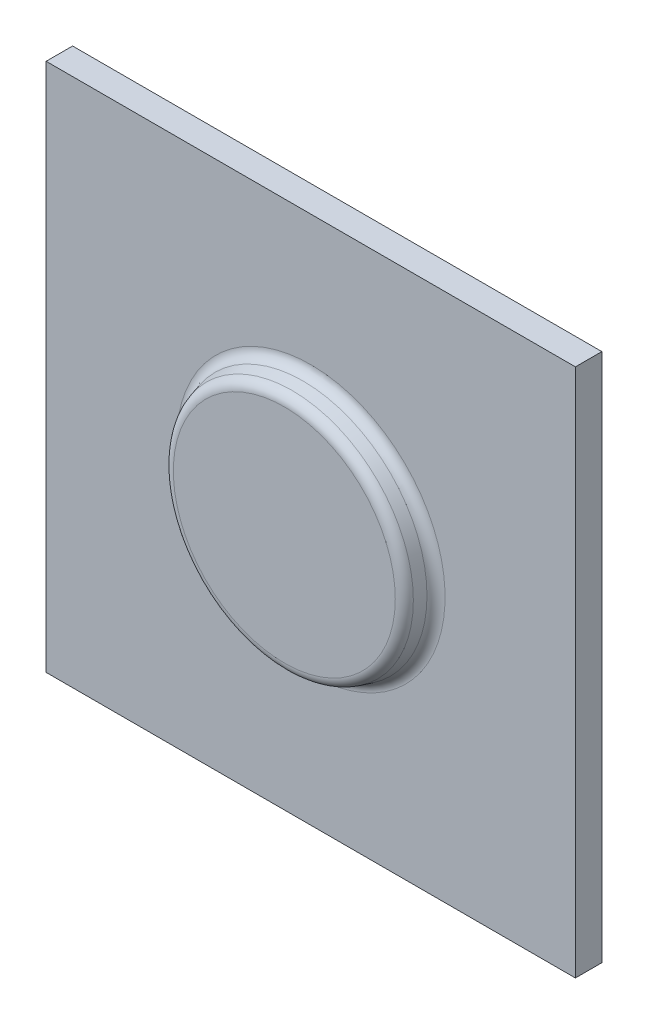
ISO-10303-21;
HEADER;
FILE_DESCRIPTION(('STEP AP214'),'2;1');
FILE_NAME('part.step','',(''),(''),'','','');
FILE_SCHEMA(('AUTOMOTIVE_DESIGN { 1 0 10303 214 1 1 1 1 }'));
ENDSEC;
DATA;
#1=APPLICATION_CONTEXT('core data for automotive mechanical design processes');
#2=APPLICATION_PROTOCOL_DEFINITION('international standard','automotive_design',2000,#1);
#3=PRODUCT_CONTEXT('',#1,'mechanical');
#4=PRODUCT('Part','Part','',(#3));
#5=PRODUCT_RELATED_PRODUCT_CATEGORY('part','',(#4));
#6=PRODUCT_DEFINITION_FORMATION('','',#4);
#7=PRODUCT_DEFINITION_CONTEXT('part definition',#1,'design');
#8=PRODUCT_DEFINITION('design','',#6,#7);
#9=PRODUCT_DEFINITION_SHAPE('','',#8);
#10=(LENGTH_UNIT() NAMED_UNIT(*) SI_UNIT(.MILLI.,.METRE.));
#11=(NAMED_UNIT(*) PLANE_ANGLE_UNIT() SI_UNIT($,.RADIAN.));
#12=(NAMED_UNIT(*) SI_UNIT($,.STERADIAN.) SOLID_ANGLE_UNIT());
#13=UNCERTAINTY_MEASURE_WITH_UNIT(LENGTH_MEASURE(1.E-05),#10,'distance_accuracy_value','');
#14=(GEOMETRIC_REPRESENTATION_CONTEXT(3) GLOBAL_UNCERTAINTY_ASSIGNED_CONTEXT((#13)) GLOBAL_UNIT_ASSIGNED_CONTEXT((#10,
#11,#12)) REPRESENTATION_CONTEXT('',''));
#15=CARTESIAN_POINT('',(0.,0.,0.));
#16=DIRECTION('',(0.,0.,1.));
#17=DIRECTION('',(1.,0.,0.));
#18=AXIS2_PLACEMENT_3D('',#15,#16,#17);
#19=CARTESIAN_POINT('',(-50.,50.,5.));
#20=DIRECTION('',(1.,0.,0.));
#21=DIRECTION('',(0.,1.,0.));
#22=AXIS2_PLACEMENT_3D('',#19,#20,#21);
#23=PLANE('',#22);
#24=DIRECTION('',(0.,-1.,0.));
#25=VECTOR('',#24,1.);
#26=CARTESIAN_POINT('',(-50.,50.,0.));
#27=LINE('',#26,#25);
#28=CARTESIAN_POINT('',(-50.,50.,0.));
#29=VERTEX_POINT('',#28);
#30=CARTESIAN_POINT('',(-50.,-50.,0.));
#31=VERTEX_POINT('',#30);
#32=EDGE_CURVE('E106',#29,#31,#27,.T.);
#33=ORIENTED_EDGE('',*,*,#32,.T.);
#34=DIRECTION('',(0.,0.,-1.));
#35=VECTOR('',#34,1.);
#36=CARTESIAN_POINT('',(-50.,-50.,5.));
#37=LINE('',#36,#35);
#38=CARTESIAN_POINT('',(-50.,-50.,5.));
#39=VERTEX_POINT('',#38);
#40=EDGE_CURVE('E97',#39,#31,#37,.T.);
#41=ORIENTED_EDGE('',*,*,#40,.F.);
#42=DIRECTION('',(0.,-1.,0.));
#43=VECTOR('',#42,1.);
#44=CARTESIAN_POINT('',(-50.,50.,5.));
#45=LINE('',#44,#43);
#46=CARTESIAN_POINT('',(-50.,50.,5.));
#47=VERTEX_POINT('',#46);
#48=EDGE_CURVE('E91',#47,#39,#45,.T.);
#49=ORIENTED_EDGE('',*,*,#48,.F.);
#50=DIRECTION('',(0.,0.,-1.));
#51=VECTOR('',#50,1.);
#52=CARTESIAN_POINT('',(-50.,50.,5.));
#53=LINE('',#52,#51);
#54=EDGE_CURVE('E102',#47,#29,#53,.T.);
#55=ORIENTED_EDGE('',*,*,#54,.T.);
#56=EDGE_LOOP('',(#33,#41,#49,#55));
#57=FACE_BOUND('',#56,.T.);
#58=ADVANCED_FACE('F38',(#57),#23,.F.);
#59=CARTESIAN_POINT('',(50.,-50.,5.));
#60=DIRECTION('',(0.,1.,0.));
#61=DIRECTION('',(-1.,0.,0.));
#62=AXIS2_PLACEMENT_3D('',#59,#60,#61);
#63=PLANE('',#62);
#64=DIRECTION('',(1.,0.,0.));
#65=VECTOR('',#64,1.);
#66=CARTESIAN_POINT('',(50.,-50.,0.));
#67=LINE('',#66,#65);
#68=CARTESIAN_POINT('',(50.,-50.,0.));
#69=VERTEX_POINT('',#68);
#70=EDGE_CURVE('E96',#31,#69,#67,.T.);
#71=ORIENTED_EDGE('',*,*,#70,.T.);
#72=DIRECTION('',(0.,0.,-1.));
#73=VECTOR('',#72,1.);
#74=CARTESIAN_POINT('',(50.,-50.,5.));
#75=LINE('',#74,#73);
#76=CARTESIAN_POINT('',(50.,-50.,5.));
#77=VERTEX_POINT('',#76);
#78=EDGE_CURVE('E94',#77,#69,#75,.T.);
#79=ORIENTED_EDGE('',*,*,#78,.F.);
#80=DIRECTION('',(1.,0.,0.));
#81=VECTOR('',#80,1.);
#82=CARTESIAN_POINT('',(50.,-50.,5.));
#83=LINE('',#82,#81);
#84=EDGE_CURVE('E86',#39,#77,#83,.T.);
#85=ORIENTED_EDGE('',*,*,#84,.F.);
#86=ORIENTED_EDGE('',*,*,#40,.T.);
#87=EDGE_LOOP('',(#71,#79,#85,#86));
#88=FACE_BOUND('',#87,.T.);
#89=ADVANCED_FACE('F95',(#88),#63,.F.);
#90=CARTESIAN_POINT('',(50.,50.,5.));
#91=DIRECTION('',(-1.,0.,0.));
#92=DIRECTION('',(0.,-1.,0.));
#93=AXIS2_PLACEMENT_3D('',#90,#91,#92);
#94=PLANE('',#93);
#95=DIRECTION('',(0.,1.,0.));
#96=VECTOR('',#95,1.);
#97=CARTESIAN_POINT('',(50.,50.,0.));
#98=LINE('',#97,#96);
#99=CARTESIAN_POINT('',(50.,50.,0.));
#100=VERTEX_POINT('',#99);
#101=EDGE_CURVE('E72',#69,#100,#98,.T.);
#102=ORIENTED_EDGE('',*,*,#101,.T.);
#103=DIRECTION('',(0.,0.,-1.));
#104=VECTOR('',#103,1.);
#105=CARTESIAN_POINT('',(50.,50.,5.));
#106=LINE('',#105,#104);
#107=CARTESIAN_POINT('',(50.,50.,5.));
#108=VERTEX_POINT('',#107);
#109=EDGE_CURVE('E98',#108,#100,#106,.T.);
#110=ORIENTED_EDGE('',*,*,#109,.F.);
#111=DIRECTION('',(0.,1.,0.));
#112=VECTOR('',#111,1.);
#113=CARTESIAN_POINT('',(50.,50.,5.));
#114=LINE('',#113,#112);
#115=EDGE_CURVE('E89',#77,#108,#114,.T.);
#116=ORIENTED_EDGE('',*,*,#115,.F.);
#117=ORIENTED_EDGE('',*,*,#78,.T.);
#118=EDGE_LOOP('',(#102,#110,#116,#117));
#119=FACE_BOUND('',#118,.T.);
#120=ADVANCED_FACE('F100',(#119),#94,.F.);
#121=CARTESIAN_POINT('',(50.,50.,5.));
#122=DIRECTION('',(0.,-1.,0.));
#123=DIRECTION('',(1.,0.,0.));
#124=AXIS2_PLACEMENT_3D('',#121,#122,#123);
#125=PLANE('',#124);
#126=DIRECTION('',(-1.,0.,0.));
#127=VECTOR('',#126,1.);
#128=CARTESIAN_POINT('',(50.,50.,0.));
#129=LINE('',#128,#127);
#130=EDGE_CURVE('E78',#100,#29,#129,.T.);
#131=ORIENTED_EDGE('',*,*,#130,.T.);
#132=ORIENTED_EDGE('',*,*,#54,.F.);
#133=DIRECTION('',(-1.,0.,0.));
#134=VECTOR('',#133,1.);
#135=CARTESIAN_POINT('',(50.,50.,5.));
#136=LINE('',#135,#134);
#137=EDGE_CURVE('E55',#108,#47,#136,.T.);
#138=ORIENTED_EDGE('',*,*,#137,.F.);
#139=ORIENTED_EDGE('',*,*,#109,.T.);
#140=EDGE_LOOP('',(#131,#132,#138,#139));
#141=FACE_BOUND('',#140,.T.);
#142=ADVANCED_FACE('F156',(#141),#125,.F.);
#143=CARTESIAN_POINT('',(0.,0.,5.));
#144=DIRECTION('',(0.,0.,-1.));
#145=DIRECTION('',(-1.,0.,0.));
#146=AXIS2_PLACEMENT_3D('',#143,#144,#145);
#147=PLANE('',#146);
#148=CARTESIAN_POINT('',(0.,0.,5.));
#149=DIRECTION('',(0.,0.,-1.));
#150=DIRECTION('',(-1.,0.,0.));
#151=AXIS2_PLACEMENT_3D('',#148,#149,#150);
#152=CIRCLE('',#151,25.3743999381135);
#153=CARTESIAN_POINT('',(-25.3743999381135,0.,5.));
#154=VERTEX_POINT('',#153);
#155=EDGE_CURVE('E47',#154,#154,#152,.T.);
#156=ORIENTED_EDGE('',*,*,#155,.T.);
#157=EDGE_LOOP('',(#156));
#158=FACE_BOUND('',#157,.T.);
#159=ORIENTED_EDGE('',*,*,#48,.T.);
#160=ORIENTED_EDGE('',*,*,#84,.T.);
#161=ORIENTED_EDGE('',*,*,#115,.T.);
#162=ORIENTED_EDGE('',*,*,#137,.T.);
#163=EDGE_LOOP('',(#159,#160,#161,#162));
#164=FACE_BOUND('',#163,.T.);
#165=ADVANCED_FACE('F87',(#158,#164),#147,.F.);
#166=CARTESIAN_POINT('',(0.,0.,0.));
#167=DIRECTION('',(0.,0.,-1.));
#168=DIRECTION('',(-1.,0.,0.));
#169=AXIS2_PLACEMENT_3D('',#166,#167,#168);
#170=PLANE('',#169);
#171=ORIENTED_EDGE('',*,*,#32,.F.);
#172=ORIENTED_EDGE('',*,*,#130,.F.);
#173=ORIENTED_EDGE('',*,*,#101,.F.);
#174=ORIENTED_EDGE('',*,*,#70,.F.);
#175=EDGE_LOOP('',(#171,#172,#173,#174));
#176=FACE_BOUND('',#175,.T.);
#177=ADVANCED_FACE('F133',(#176),#170,.T.);
#178=CARTESIAN_POINT('',(0.,0.,10.));
#179=DIRECTION('',(0.,0.,-1.));
#180=DIRECTION('',(1.,0.,0.));
#181=AXIS2_PLACEMENT_3D('',#178,#179,#180);
#182=CONICAL_SURFACE('',#181,22.5,0.26179938779915);
#183=CARTESIAN_POINT('',(0.,0.,6.48236190979496));
#184=DIRECTION('',(0.,0.,-1.));
#185=DIRECTION('',(-1.,0.,0.));
#186=AXIS2_PLACEMENT_3D('',#183,#184,#185);
#187=CIRCLE('',#186,23.4425482855354);
#188=CARTESIAN_POINT('',(-23.4425482855354,0.,6.48236190979496));
#189=VERTEX_POINT('',#188);
#190=EDGE_CURVE('E118',#189,#189,#187,.F.);
#191=ORIENTED_EDGE('',*,*,#190,.T.);
#192=EDGE_LOOP('',(#191));
#193=FACE_BOUND('',#192,.T.);
#194=CARTESIAN_POINT('',(0.,0.,8.51763809020504));
#195=DIRECTION('',(0.,0.,-1.));
#196=DIRECTION('',(-1.,0.,0.));
#197=AXIS2_PLACEMENT_3D('',#194,#195,#196);
#198=CIRCLE('',#197,22.8971976766202);
#199=CARTESIAN_POINT('',(-22.8971976766202,0.,8.51763809020504));
#200=VERTEX_POINT('',#199);
#201=EDGE_CURVE('E115',#200,#200,#198,.T.);
#202=ORIENTED_EDGE('',*,*,#201,.T.);
#203=EDGE_LOOP('',(#202));
#204=FACE_BOUND('',#203,.T.);
#205=ADVANCED_FACE('F130',(#193,#204),#182,.T.);
#206=CARTESIAN_POINT('',(0.,0.,10.));
#207=DIRECTION('',(0.,0.,1.));
#208=DIRECTION('',(1.,0.,0.));
#209=AXIS2_PLACEMENT_3D('',#206,#207,#208);
#210=PLANE('',#209);
#211=CARTESIAN_POINT('',(0.,0.,10.));
#212=DIRECTION('',(0.,0.,1.));
#213=DIRECTION('',(1.,0.,0.));
#214=AXIS2_PLACEMENT_3D('',#211,#212,#213);
#215=CIRCLE('',#214,20.9653460240421);
#216=CARTESIAN_POINT('',(20.9653460240421,0.,10.));
#217=VERTEX_POINT('',#216);
#218=EDGE_CURVE('E12',#217,#217,#215,.T.);
#219=ORIENTED_EDGE('',*,*,#218,.T.);
#220=EDGE_LOOP('',(#219));
#221=FACE_BOUND('',#220,.T.);
#222=ADVANCED_FACE('F127',(#221),#210,.T.);
#223=CARTESIAN_POINT('',(0.,0.,7.));
#224=DIRECTION('',(0.,0.,-1.));
#225=DIRECTION('',(-1.,0.,0.));
#226=AXIS2_PLACEMENT_3D('',#223,#224,#225);
#227=TOROIDAL_SURFACE('',#226,25.3743999381135,2.);
#228=ORIENTED_EDGE('',*,*,#155,.F.);
#229=EDGE_LOOP('',(#228));
#230=FACE_BOUND('',#229,.T.);
#231=ORIENTED_EDGE('',*,*,#190,.F.);
#232=EDGE_LOOP('',(#231));
#233=FACE_BOUND('',#232,.T.);
#234=ADVANCED_FACE('F124',(#230,#233),#227,.F.);
#235=CARTESIAN_POINT('',(0.,0.,8.));
#236=DIRECTION('',(0.,0.,1.));
#237=DIRECTION('',(1.,0.,0.));
#238=AXIS2_PLACEMENT_3D('',#235,#236,#237);
#239=TOROIDAL_SURFACE('',#238,20.9653460240421,2.);
#240=ORIENTED_EDGE('',*,*,#201,.F.);
#241=EDGE_LOOP('',(#240));
#242=FACE_BOUND('',#241,.T.);
#243=ORIENTED_EDGE('',*,*,#218,.F.);
#244=EDGE_LOOP('',(#243));
#245=FACE_BOUND('',#244,.T.);
#246=ADVANCED_FACE('F40',(#242,#245),#239,.T.);
#247=CLOSED_SHELL('',(#58,#89,#120,#142,#165,#177,#205,#222,#234,#246));
#248=MANIFOLD_SOLID_BREP('B2',#247);
#249=ADVANCED_BREP_SHAPE_REPRESENTATION('',(#18,#248),#14);
#250=SHAPE_DEFINITION_REPRESENTATION(#9,#249);
ENDSEC;
END-ISO-10303-21;
